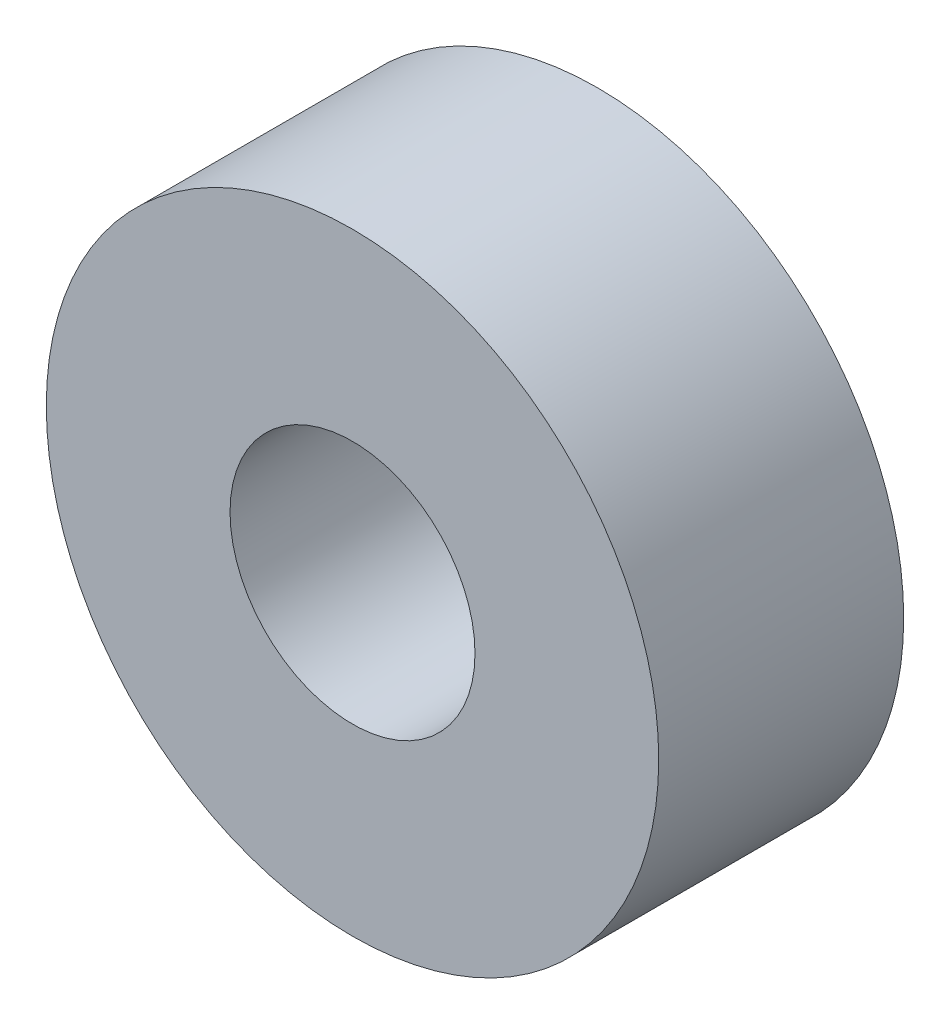
ISO-10303-21;
HEADER;
FILE_DESCRIPTION(('STEP AP214'),'2;1');
FILE_NAME('part.step','',(''),(''),'','','');
FILE_SCHEMA(('AUTOMOTIVE_DESIGN { 1 0 10303 214 1 1 1 1 }'));
ENDSEC;
DATA;
#1=APPLICATION_CONTEXT('core data for automotive mechanical design processes');
#2=APPLICATION_PROTOCOL_DEFINITION('international standard','automotive_design',2000,#1);
#3=PRODUCT_CONTEXT('',#1,'mechanical');
#4=PRODUCT('Part','Part','',(#3));
#5=PRODUCT_RELATED_PRODUCT_CATEGORY('part','',(#4));
#6=PRODUCT_DEFINITION_FORMATION('','',#4);
#7=PRODUCT_DEFINITION_CONTEXT('part definition',#1,'design');
#8=PRODUCT_DEFINITION('design','',#6,#7);
#9=PRODUCT_DEFINITION_SHAPE('','',#8);
#10=(LENGTH_UNIT() NAMED_UNIT(*) SI_UNIT(.MILLI.,.METRE.));
#11=(NAMED_UNIT(*) PLANE_ANGLE_UNIT() SI_UNIT($,.RADIAN.));
#12=(NAMED_UNIT(*) SI_UNIT($,.STERADIAN.) SOLID_ANGLE_UNIT());
#13=UNCERTAINTY_MEASURE_WITH_UNIT(LENGTH_MEASURE(1.E-05),#10,'distance_accuracy_value','');
#14=(GEOMETRIC_REPRESENTATION_CONTEXT(3) GLOBAL_UNCERTAINTY_ASSIGNED_CONTEXT((#13)) GLOBAL_UNIT_ASSIGNED_CONTEXT((#10,
#11,#12)) REPRESENTATION_CONTEXT('',''));
#15=CARTESIAN_POINT('',(0.,0.,0.));
#16=DIRECTION('',(0.,0.,1.));
#17=DIRECTION('',(1.,0.,0.));
#18=AXIS2_PLACEMENT_3D('',#15,#16,#17);
#19=CARTESIAN_POINT('',(-11.8370702809443,28.2475540795261,4.));
#20=DIRECTION('',(0.,0.,-1.));
#21=DIRECTION('',(-1.,0.,0.));
#22=AXIS2_PLACEMENT_3D('',#19,#20,#21);
#23=CYLINDRICAL_SURFACE('',#22,5.);
#24=CARTESIAN_POINT('',(-11.8370702809443,28.2475540795261,4.));
#25=DIRECTION('',(0.,0.,1.));
#26=DIRECTION('',(1.,0.,0.));
#27=AXIS2_PLACEMENT_3D('',#24,#25,#26);
#28=CIRCLE('',#27,5.);
#29=CARTESIAN_POINT('',(-6.83707028094428,28.2475540795261,4.));
#30=VERTEX_POINT('',#29);
#31=EDGE_CURVE('E10',#30,#30,#28,.T.);
#32=ORIENTED_EDGE('',*,*,#31,.F.);
#33=EDGE_LOOP('',(#32));
#34=FACE_BOUND('',#33,.T.);
#35=CARTESIAN_POINT('',(-11.8370702809443,28.2475540795261,0.));
#36=DIRECTION('',(0.,0.,1.));
#37=DIRECTION('',(1.,0.,0.));
#38=AXIS2_PLACEMENT_3D('',#35,#36,#37);
#39=CIRCLE('',#38,5.);
#40=CARTESIAN_POINT('',(-6.83707028094428,28.2475540795261,0.));
#41=VERTEX_POINT('',#40);
#42=EDGE_CURVE('E39',#41,#41,#39,.T.);
#43=ORIENTED_EDGE('',*,*,#42,.T.);
#44=EDGE_LOOP('',(#43));
#45=FACE_BOUND('',#44,.T.);
#46=ADVANCED_FACE('F36',(#34,#45),#23,.T.);
#47=CARTESIAN_POINT('',(-11.8370702809443,28.2475540795261,4.));
#48=DIRECTION('',(0.,0.,1.));
#49=DIRECTION('',(1.,0.,0.));
#50=AXIS2_PLACEMENT_3D('',#47,#48,#49);
#51=PLANE('',#50);
#52=CARTESIAN_POINT('',(-11.8370702809443,28.2475540795261,4.));
#53=DIRECTION('',(0.,0.,1.));
#54=DIRECTION('',(1.,0.,0.));
#55=AXIS2_PLACEMENT_3D('',#52,#53,#54);
#56=CIRCLE('',#55,2.);
#57=CARTESIAN_POINT('',(-9.83707028094428,28.2475540795261,4.));
#58=VERTEX_POINT('',#57);
#59=EDGE_CURVE('E48',#58,#58,#56,.T.);
#60=ORIENTED_EDGE('',*,*,#59,.F.);
#61=EDGE_LOOP('',(#60));
#62=FACE_BOUND('',#61,.T.);
#63=ORIENTED_EDGE('',*,*,#31,.T.);
#64=EDGE_LOOP('',(#63));
#65=FACE_BOUND('',#64,.T.);
#66=ADVANCED_FACE('F63',(#62,#65),#51,.T.);
#67=CARTESIAN_POINT('',(-11.8370702809443,28.2475540795261,0.));
#68=DIRECTION('',(0.,0.,1.));
#69=DIRECTION('',(1.,0.,0.));
#70=AXIS2_PLACEMENT_3D('',#67,#68,#69);
#71=PLANE('',#70);
#72=CARTESIAN_POINT('',(-11.8370702809443,28.2475540795261,0.));
#73=DIRECTION('',(0.,0.,1.));
#74=DIRECTION('',(1.,0.,0.));
#75=AXIS2_PLACEMENT_3D('',#72,#73,#74);
#76=CIRCLE('',#75,2.);
#77=CARTESIAN_POINT('',(-9.83707028094428,28.2475540795261,0.));
#78=VERTEX_POINT('',#77);
#79=EDGE_CURVE('E46',#78,#78,#76,.T.);
#80=ORIENTED_EDGE('',*,*,#79,.T.);
#81=EDGE_LOOP('',(#80));
#82=FACE_BOUND('',#81,.T.);
#83=ORIENTED_EDGE('',*,*,#42,.F.);
#84=EDGE_LOOP('',(#83));
#85=FACE_BOUND('',#84,.T.);
#86=ADVANCED_FACE('F54',(#82,#85),#71,.F.);
#87=CARTESIAN_POINT('',(-11.8370702809443,28.2475540795261,0.));
#88=DIRECTION('',(0.,0.,1.));
#89=DIRECTION('',(1.,0.,0.));
#90=AXIS2_PLACEMENT_3D('',#87,#88,#89);
#91=CYLINDRICAL_SURFACE('',#90,2.);
#92=ORIENTED_EDGE('',*,*,#79,.F.);
#93=EDGE_LOOP('',(#92));
#94=FACE_BOUND('',#93,.T.);
#95=ORIENTED_EDGE('',*,*,#59,.T.);
#96=EDGE_LOOP('',(#95));
#97=FACE_BOUND('',#96,.T.);
#98=ADVANCED_FACE('F57',(#94,#97),#91,.F.);
#99=CLOSED_SHELL('',(#46,#66,#86,#98));
#100=MANIFOLD_SOLID_BREP('B2',#99);
#101=ADVANCED_BREP_SHAPE_REPRESENTATION('',(#18,#100),#14);
#102=SHAPE_DEFINITION_REPRESENTATION(#9,#101);
ENDSEC;
END-ISO-10303-21;
